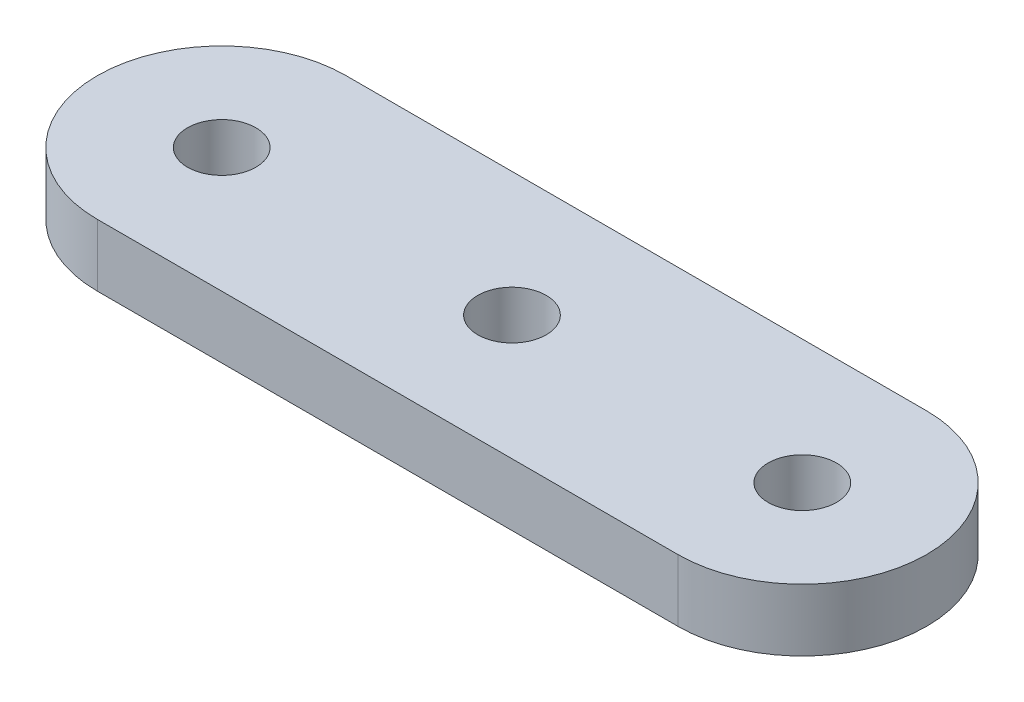
ISO-10303-21;
HEADER;
FILE_DESCRIPTION(('STEP AP214'),'2;1');
FILE_NAME('part.step','',(''),(''),'','','');
FILE_SCHEMA(('AUTOMOTIVE_DESIGN { 1 0 10303 214 1 1 1 1 }'));
ENDSEC;
DATA;
#1=APPLICATION_CONTEXT('core data for automotive mechanical design processes');
#2=APPLICATION_PROTOCOL_DEFINITION('international standard','automotive_design',2000,#1);
#3=PRODUCT_CONTEXT('',#1,'mechanical');
#4=PRODUCT('Part','Part','',(#3));
#5=PRODUCT_RELATED_PRODUCT_CATEGORY('part','',(#4));
#6=PRODUCT_DEFINITION_FORMATION('','',#4);
#7=PRODUCT_DEFINITION_CONTEXT('part definition',#1,'design');
#8=PRODUCT_DEFINITION('design','',#6,#7);
#9=PRODUCT_DEFINITION_SHAPE('','',#8);
#10=(LENGTH_UNIT() NAMED_UNIT(*) SI_UNIT(.MILLI.,.METRE.));
#11=(NAMED_UNIT(*) PLANE_ANGLE_UNIT() SI_UNIT($,.RADIAN.));
#12=(NAMED_UNIT(*) SI_UNIT($,.STERADIAN.) SOLID_ANGLE_UNIT());
#13=UNCERTAINTY_MEASURE_WITH_UNIT(LENGTH_MEASURE(1.E-05),#10,'distance_accuracy_value','');
#14=(GEOMETRIC_REPRESENTATION_CONTEXT(3) GLOBAL_UNCERTAINTY_ASSIGNED_CONTEXT((#13)) GLOBAL_UNIT_ASSIGNED_CONTEXT((#10,
#11,#12)) REPRESENTATION_CONTEXT('',''));
#15=CARTESIAN_POINT('',(0.,0.,0.));
#16=DIRECTION('',(0.,0.,1.));
#17=DIRECTION('',(1.,0.,0.));
#18=AXIS2_PLACEMENT_3D('',#15,#16,#17);
#19=CARTESIAN_POINT('',(-28.,3.,0.));
#20=DIRECTION('',(0.,-1.,0.));
#21=DIRECTION('',(0.,0.,-1.));
#22=AXIS2_PLACEMENT_3D('',#19,#20,#21);
#23=CYLINDRICAL_SURFACE('',#22,6.);
#24=CARTESIAN_POINT('',(-28.,0.,0.));
#25=DIRECTION('',(0.,1.,0.));
#26=DIRECTION('',(0.,0.,1.));
#27=AXIS2_PLACEMENT_3D('',#24,#25,#26);
#28=CIRCLE('',#27,6.);
#29=CARTESIAN_POINT('',(-28.,0.,-6.));
#30=VERTEX_POINT('',#29);
#31=CARTESIAN_POINT('',(-28.,0.,6.));
#32=VERTEX_POINT('',#31);
#33=EDGE_CURVE('E126',#30,#32,#28,.T.);
#34=ORIENTED_EDGE('',*,*,#33,.T.);
#35=DIRECTION('',(0.,-1.,0.));
#36=VECTOR('',#35,1.);
#37=CARTESIAN_POINT('',(-28.,3.,6.));
#38=LINE('',#37,#36);
#39=CARTESIAN_POINT('',(-28.,3.,6.));
#40=VERTEX_POINT('',#39);
#41=EDGE_CURVE('E11',#40,#32,#38,.T.);
#42=ORIENTED_EDGE('',*,*,#41,.F.);
#43=CARTESIAN_POINT('',(-28.,3.,0.));
#44=DIRECTION('',(0.,1.,0.));
#45=DIRECTION('',(0.,0.,1.));
#46=AXIS2_PLACEMENT_3D('',#43,#44,#45);
#47=CIRCLE('',#46,6.);
#48=CARTESIAN_POINT('',(-28.,3.,-6.));
#49=VERTEX_POINT('',#48);
#50=EDGE_CURVE('E108',#49,#40,#47,.T.);
#51=ORIENTED_EDGE('',*,*,#50,.F.);
#52=DIRECTION('',(0.,-1.,0.));
#53=VECTOR('',#52,1.);
#54=CARTESIAN_POINT('',(-28.,3.,-6.));
#55=LINE('',#54,#53);
#56=EDGE_CURVE('E122',#49,#30,#55,.T.);
#57=ORIENTED_EDGE('',*,*,#56,.T.);
#58=EDGE_LOOP('',(#34,#42,#51,#57));
#59=FACE_BOUND('',#58,.T.);
#60=ADVANCED_FACE('F55',(#59),#23,.T.);
#61=CARTESIAN_POINT('',(-28.,3.,6.));
#62=DIRECTION('',(0.,0.,-1.));
#63=DIRECTION('',(-1.,0.,0.));
#64=AXIS2_PLACEMENT_3D('',#61,#62,#63);
#65=PLANE('',#64);
#66=DIRECTION('',(1.,0.,0.));
#67=VECTOR('',#66,1.);
#68=CARTESIAN_POINT('',(-28.,0.,6.));
#69=LINE('',#68,#67);
#70=CARTESIAN_POINT('',(0.,0.,6.));
#71=VERTEX_POINT('',#70);
#72=EDGE_CURVE('E113',#32,#71,#69,.T.);
#73=ORIENTED_EDGE('',*,*,#72,.T.);
#74=DIRECTION('',(0.,-1.,0.));
#75=VECTOR('',#74,1.);
#76=CARTESIAN_POINT('',(0.,3.,6.));
#77=LINE('',#76,#75);
#78=CARTESIAN_POINT('',(0.,3.,6.));
#79=VERTEX_POINT('',#78);
#80=EDGE_CURVE('E65',#79,#71,#77,.T.);
#81=ORIENTED_EDGE('',*,*,#80,.F.);
#82=DIRECTION('',(1.,0.,0.));
#83=VECTOR('',#82,1.);
#84=CARTESIAN_POINT('',(-28.,3.,6.));
#85=LINE('',#84,#83);
#86=EDGE_CURVE('E103',#40,#79,#85,.T.);
#87=ORIENTED_EDGE('',*,*,#86,.F.);
#88=ORIENTED_EDGE('',*,*,#41,.T.);
#89=EDGE_LOOP('',(#73,#81,#87,#88));
#90=FACE_BOUND('',#89,.T.);
#91=ADVANCED_FACE('F112',(#90),#65,.F.);
#92=CARTESIAN_POINT('',(0.,3.,0.));
#93=DIRECTION('',(0.,-1.,0.));
#94=DIRECTION('',(0.,0.,-1.));
#95=AXIS2_PLACEMENT_3D('',#92,#93,#94);
#96=CYLINDRICAL_SURFACE('',#95,6.);
#97=CARTESIAN_POINT('',(0.,0.,0.));
#98=DIRECTION('',(0.,1.,0.));
#99=DIRECTION('',(0.,0.,1.));
#100=AXIS2_PLACEMENT_3D('',#97,#98,#99);
#101=CIRCLE('',#100,6.);
#102=CARTESIAN_POINT('',(0.,0.,-6.));
#103=VERTEX_POINT('',#102);
#104=EDGE_CURVE('E90',#71,#103,#101,.T.);
#105=ORIENTED_EDGE('',*,*,#104,.T.);
#106=DIRECTION('',(0.,-1.,0.));
#107=VECTOR('',#106,1.);
#108=CARTESIAN_POINT('',(0.,3.,-6.));
#109=LINE('',#108,#107);
#110=CARTESIAN_POINT('',(0.,3.,-6.));
#111=VERTEX_POINT('',#110);
#112=EDGE_CURVE('E115',#111,#103,#109,.T.);
#113=ORIENTED_EDGE('',*,*,#112,.F.);
#114=CARTESIAN_POINT('',(0.,3.,0.));
#115=DIRECTION('',(0.,1.,0.));
#116=DIRECTION('',(0.,0.,1.));
#117=AXIS2_PLACEMENT_3D('',#114,#115,#116);
#118=CIRCLE('',#117,6.);
#119=EDGE_CURVE('E106',#79,#111,#118,.T.);
#120=ORIENTED_EDGE('',*,*,#119,.F.);
#121=ORIENTED_EDGE('',*,*,#80,.T.);
#122=EDGE_LOOP('',(#105,#113,#120,#121));
#123=FACE_BOUND('',#122,.T.);
#124=ADVANCED_FACE('F117',(#123),#96,.T.);
#125=CARTESIAN_POINT('',(-28.,3.,-6.));
#126=DIRECTION('',(0.,0.,1.));
#127=DIRECTION('',(1.,0.,0.));
#128=AXIS2_PLACEMENT_3D('',#125,#126,#127);
#129=PLANE('',#128);
#130=DIRECTION('',(-1.,0.,0.));
#131=VECTOR('',#130,1.);
#132=CARTESIAN_POINT('',(-28.,0.,-6.));
#133=LINE('',#132,#131);
#134=EDGE_CURVE('E96',#103,#30,#133,.T.);
#135=ORIENTED_EDGE('',*,*,#134,.T.);
#136=ORIENTED_EDGE('',*,*,#56,.F.);
#137=DIRECTION('',(-1.,0.,0.));
#138=VECTOR('',#137,1.);
#139=CARTESIAN_POINT('',(-28.,3.,-6.));
#140=LINE('',#139,#138);
#141=EDGE_CURVE('E73',#111,#49,#140,.T.);
#142=ORIENTED_EDGE('',*,*,#141,.F.);
#143=ORIENTED_EDGE('',*,*,#112,.T.);
#144=EDGE_LOOP('',(#135,#136,#142,#143));
#145=FACE_BOUND('',#144,.T.);
#146=ADVANCED_FACE('F141',(#145),#129,.F.);
#147=CARTESIAN_POINT('',(-28.,3.,0.));
#148=DIRECTION('',(0.,1.,0.));
#149=DIRECTION('',(0.,0.,1.));
#150=AXIS2_PLACEMENT_3D('',#147,#148,#149);
#151=PLANE('',#150);
#152=CARTESIAN_POINT('',(0.,3.,0.));
#153=DIRECTION('',(0.,1.,0.));
#154=DIRECTION('',(0.,0.,1.));
#155=AXIS2_PLACEMENT_3D('',#152,#153,#154);
#156=CIRCLE('',#155,1.64999999999999);
#157=CARTESIAN_POINT('',(0.,3.,1.64999999999999));
#158=VERTEX_POINT('',#157);
#159=EDGE_CURVE('E164',#158,#158,#156,.T.);
#160=ORIENTED_EDGE('',*,*,#159,.F.);
#161=EDGE_LOOP('',(#160));
#162=FACE_BOUND('',#161,.T.);
#163=CARTESIAN_POINT('',(-14.,3.,0.));
#164=DIRECTION('',(0.,1.,0.));
#165=DIRECTION('',(0.,0.,1.));
#166=AXIS2_PLACEMENT_3D('',#163,#164,#165);
#167=CIRCLE('',#166,1.64999999999999);
#168=CARTESIAN_POINT('',(-14.,3.,1.64999999999999));
#169=VERTEX_POINT('',#168);
#170=EDGE_CURVE('E156',#169,#169,#167,.T.);
#171=ORIENTED_EDGE('',*,*,#170,.F.);
#172=EDGE_LOOP('',(#171));
#173=FACE_BOUND('',#172,.T.);
#174=CARTESIAN_POINT('',(-28.,3.,0.));
#175=DIRECTION('',(0.,1.,0.));
#176=DIRECTION('',(0.,0.,1.));
#177=AXIS2_PLACEMENT_3D('',#174,#175,#176);
#178=CIRCLE('',#177,1.64999999999999);
#179=CARTESIAN_POINT('',(-28.,3.,1.64999999999999));
#180=VERTEX_POINT('',#179);
#181=EDGE_CURVE('E152',#180,#180,#178,.T.);
#182=ORIENTED_EDGE('',*,*,#181,.F.);
#183=EDGE_LOOP('',(#182));
#184=FACE_BOUND('',#183,.T.);
#185=ORIENTED_EDGE('',*,*,#50,.T.);
#186=ORIENTED_EDGE('',*,*,#86,.T.);
#187=ORIENTED_EDGE('',*,*,#119,.T.);
#188=ORIENTED_EDGE('',*,*,#141,.T.);
#189=EDGE_LOOP('',(#185,#186,#187,#188));
#190=FACE_BOUND('',#189,.T.);
#191=ADVANCED_FACE('F104',(#162,#173,#184,#190),#151,.T.);
#192=CARTESIAN_POINT('',(-28.,0.,0.));
#193=DIRECTION('',(0.,1.,0.));
#194=DIRECTION('',(0.,0.,1.));
#195=AXIS2_PLACEMENT_3D('',#192,#193,#194);
#196=PLANE('',#195);
#197=CARTESIAN_POINT('',(0.,0.,0.));
#198=DIRECTION('',(0.,1.,0.));
#199=DIRECTION('',(0.,0.,1.));
#200=AXIS2_PLACEMENT_3D('',#197,#198,#199);
#201=CIRCLE('',#200,1.64999999999999);
#202=CARTESIAN_POINT('',(0.,0.,1.64999999999999));
#203=VERTEX_POINT('',#202);
#204=EDGE_CURVE('E160',#203,#203,#201,.T.);
#205=ORIENTED_EDGE('',*,*,#204,.T.);
#206=EDGE_LOOP('',(#205));
#207=FACE_BOUND('',#206,.T.);
#208=CARTESIAN_POINT('',(-14.,0.,0.));
#209=DIRECTION('',(0.,1.,0.));
#210=DIRECTION('',(0.,0.,1.));
#211=AXIS2_PLACEMENT_3D('',#208,#209,#210);
#212=CIRCLE('',#211,1.64999999999999);
#213=CARTESIAN_POINT('',(-14.,0.,1.64999999999999));
#214=VERTEX_POINT('',#213);
#215=EDGE_CURVE('E58',#214,#214,#212,.T.);
#216=ORIENTED_EDGE('',*,*,#215,.T.);
#217=EDGE_LOOP('',(#216));
#218=FACE_BOUND('',#217,.T.);
#219=CARTESIAN_POINT('',(-28.,0.,0.));
#220=DIRECTION('',(0.,1.,0.));
#221=DIRECTION('',(0.,0.,1.));
#222=AXIS2_PLACEMENT_3D('',#219,#220,#221);
#223=CIRCLE('',#222,1.64999999999999);
#224=CARTESIAN_POINT('',(-28.,0.,1.64999999999999));
#225=VERTEX_POINT('',#224);
#226=EDGE_CURVE('E130',#225,#225,#223,.T.);
#227=ORIENTED_EDGE('',*,*,#226,.T.);
#228=EDGE_LOOP('',(#227));
#229=FACE_BOUND('',#228,.T.);
#230=ORIENTED_EDGE('',*,*,#33,.F.);
#231=ORIENTED_EDGE('',*,*,#134,.F.);
#232=ORIENTED_EDGE('',*,*,#104,.F.);
#233=ORIENTED_EDGE('',*,*,#72,.F.);
#234=EDGE_LOOP('',(#230,#231,#232,#233));
#235=FACE_BOUND('',#234,.T.);
#236=ADVANCED_FACE('F144',(#207,#218,#229,#235),#196,.F.);
#237=CARTESIAN_POINT('',(-28.,3.,0.));
#238=DIRECTION('',(0.,1.,0.));
#239=DIRECTION('',(0.,0.,1.));
#240=AXIS2_PLACEMENT_3D('',#237,#238,#239);
#241=CYLINDRICAL_SURFACE('',#240,1.64999999999999);
#242=ORIENTED_EDGE('',*,*,#181,.T.);
#243=EDGE_LOOP('',(#242));
#244=FACE_BOUND('',#243,.T.);
#245=ORIENTED_EDGE('',*,*,#226,.F.);
#246=EDGE_LOOP('',(#245));
#247=FACE_BOUND('',#246,.T.);
#248=ADVANCED_FACE('F180',(#244,#247),#241,.F.);
#249=CARTESIAN_POINT('',(-14.,3.,0.));
#250=DIRECTION('',(0.,1.,0.));
#251=DIRECTION('',(0.,0.,1.));
#252=AXIS2_PLACEMENT_3D('',#249,#250,#251);
#253=CYLINDRICAL_SURFACE('',#252,1.64999999999999);
#254=ORIENTED_EDGE('',*,*,#170,.T.);
#255=EDGE_LOOP('',(#254));
#256=FACE_BOUND('',#255,.T.);
#257=ORIENTED_EDGE('',*,*,#215,.F.);
#258=EDGE_LOOP('',(#257));
#259=FACE_BOUND('',#258,.T.);
#260=ADVANCED_FACE('F183',(#256,#259),#253,.F.);
#261=CARTESIAN_POINT('',(0.,3.,0.));
#262=DIRECTION('',(0.,1.,0.));
#263=DIRECTION('',(0.,0.,1.));
#264=AXIS2_PLACEMENT_3D('',#261,#262,#263);
#265=CYLINDRICAL_SURFACE('',#264,1.64999999999999);
#266=ORIENTED_EDGE('',*,*,#159,.T.);
#267=EDGE_LOOP('',(#266));
#268=FACE_BOUND('',#267,.T.);
#269=ORIENTED_EDGE('',*,*,#204,.F.);
#270=EDGE_LOOP('',(#269));
#271=FACE_BOUND('',#270,.T.);
#272=ADVANCED_FACE('F170',(#268,#271),#265,.F.);
#273=CLOSED_SHELL('',(#60,#91,#124,#146,#191,#236,#248,#260,#272));
#274=MANIFOLD_SOLID_BREP('B2',#273);
#275=ADVANCED_BREP_SHAPE_REPRESENTATION('',(#18,#274),#14);
#276=SHAPE_DEFINITION_REPRESENTATION(#9,#275);
ENDSEC;
END-ISO-10303-21;
